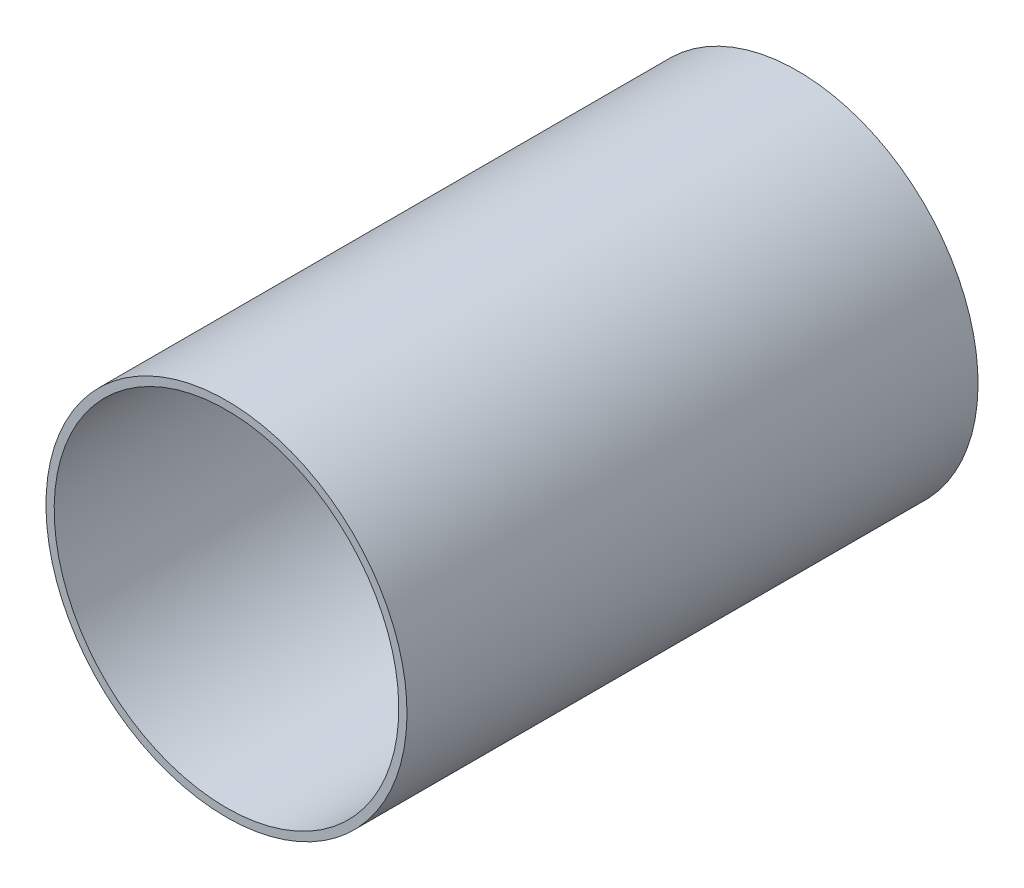
ISO-10303-21;
HEADER;
FILE_DESCRIPTION(('STEP AP214'),'2;1');
FILE_NAME('part.step','',(''),(''),'','','');
FILE_SCHEMA(('AUTOMOTIVE_DESIGN { 1 0 10303 214 1 1 1 1 }'));
ENDSEC;
DATA;
#1=APPLICATION_CONTEXT('core data for automotive mechanical design processes');
#2=APPLICATION_PROTOCOL_DEFINITION('international standard','automotive_design',2000,#1);
#3=PRODUCT_CONTEXT('',#1,'mechanical');
#4=PRODUCT('Part','Part','',(#3));
#5=PRODUCT_RELATED_PRODUCT_CATEGORY('part','',(#4));
#6=PRODUCT_DEFINITION_FORMATION('','',#4);
#7=PRODUCT_DEFINITION_CONTEXT('part definition',#1,'design');
#8=PRODUCT_DEFINITION('design','',#6,#7);
#9=PRODUCT_DEFINITION_SHAPE('','',#8);
#10=(LENGTH_UNIT() NAMED_UNIT(*) SI_UNIT(.MILLI.,.METRE.));
#11=(NAMED_UNIT(*) PLANE_ANGLE_UNIT() SI_UNIT($,.RADIAN.));
#12=(NAMED_UNIT(*) SI_UNIT($,.STERADIAN.) SOLID_ANGLE_UNIT());
#13=UNCERTAINTY_MEASURE_WITH_UNIT(LENGTH_MEASURE(1.E-05),#10,'distance_accuracy_value','');
#14=(GEOMETRIC_REPRESENTATION_CONTEXT(3) GLOBAL_UNCERTAINTY_ASSIGNED_CONTEXT((#13)) GLOBAL_UNIT_ASSIGNED_CONTEXT((#10,
#11,#12)) REPRESENTATION_CONTEXT('',''));
#15=CARTESIAN_POINT('',(0.,0.,0.));
#16=DIRECTION('',(0.,0.,1.));
#17=DIRECTION('',(1.,0.,0.));
#18=AXIS2_PLACEMENT_3D('',#15,#16,#17);
#19=CARTESIAN_POINT('',(144.202,-113.984,-0.045));
#20=DIRECTION('',(0.,0.,-1.));
#21=DIRECTION('',(0.,-1.,0.));
#22=AXIS2_PLACEMENT_3D('',#19,#20,#21);
#23=CYLINDRICAL_SURFACE('',#22,0.525);
#24=CARTESIAN_POINT('',(144.202,-113.984,-0.035));
#25=DIRECTION('',(0.,0.,-1.));
#26=DIRECTION('',(0.,-1.,0.));
#27=AXIS2_PLACEMENT_3D('',#24,#25,#26);
#28=CIRCLE('',#27,0.525);
#29=CARTESIAN_POINT('',(144.202,-114.509,-0.035));
#30=VERTEX_POINT('',#29);
#31=EDGE_CURVE('E64',#30,#30,#28,.T.);
#32=ORIENTED_EDGE('',*,*,#31,.T.);
#33=DIRECTION('',(0.,0.,1.));
#34=VECTOR('',#33,1.);
#35=CARTESIAN_POINT('',(144.202,-114.509,-0.045));
#36=LINE('',#35,#34);
#37=CARTESIAN_POINT('',(144.202,-114.509,1.705));
#38=VERTEX_POINT('',#37);
#39=EDGE_CURVE('E11',#30,#38,#36,.T.);
#40=ORIENTED_EDGE('',*,*,#39,.T.);
#41=CARTESIAN_POINT('',(144.202,-113.984,1.705));
#42=DIRECTION('',(0.,0.,-1.));
#43=DIRECTION('',(0.,-1.,0.));
#44=AXIS2_PLACEMENT_3D('',#41,#42,#43);
#45=CIRCLE('',#44,0.525);
#46=EDGE_CURVE('E25',#38,#38,#45,.T.);
#47=ORIENTED_EDGE('',*,*,#46,.F.);
#48=ORIENTED_EDGE('',*,*,#39,.F.);
#49=EDGE_LOOP('',(#32,#40,#47,#48));
#50=FACE_BOUND('',#49,.T.);
#51=ADVANCED_FACE('F17',(#50),#23,.F.);
#52=CARTESIAN_POINT('',(144.202,-114.534,1.705));
#53=DIRECTION('',(0.,0.,1.));
#54=DIRECTION('',(1.,0.,0.));
#55=AXIS2_PLACEMENT_3D('',#52,#53,#54);
#56=PLANE('',#55);
#57=ORIENTED_EDGE('',*,*,#46,.T.);
#58=EDGE_LOOP('',(#57));
#59=FACE_BOUND('',#58,.T.);
#60=CARTESIAN_POINT('',(144.202,-113.984,1.705));
#61=DIRECTION('',(0.,0.,1.));
#62=DIRECTION('',(0.,-1.,0.));
#63=AXIS2_PLACEMENT_3D('',#60,#61,#62);
#64=CIRCLE('',#63,0.55);
#65=CARTESIAN_POINT('',(144.202,-114.534,1.705));
#66=VERTEX_POINT('',#65);
#67=EDGE_CURVE('E56',#66,#66,#64,.T.);
#68=ORIENTED_EDGE('',*,*,#67,.T.);
#69=EDGE_LOOP('',(#68));
#70=FACE_BOUND('',#69,.T.);
#71=ADVANCED_FACE('F73',(#59,#70),#56,.T.);
#72=CARTESIAN_POINT('',(144.202,-114.534,-0.035));
#73=DIRECTION('',(0.,0.,1.));
#74=DIRECTION('',(1.,0.,0.));
#75=AXIS2_PLACEMENT_3D('',#72,#73,#74);
#76=PLANE('',#75);
#77=ORIENTED_EDGE('',*,*,#31,.F.);
#78=EDGE_LOOP('',(#77));
#79=FACE_BOUND('',#78,.T.);
#80=CARTESIAN_POINT('',(144.202,-113.984,-0.035));
#81=DIRECTION('',(0.,0.,1.));
#82=DIRECTION('',(0.,-1.,0.));
#83=AXIS2_PLACEMENT_3D('',#80,#81,#82);
#84=CIRCLE('',#83,0.55);
#85=CARTESIAN_POINT('',(144.202,-114.534,-0.035));
#86=VERTEX_POINT('',#85);
#87=EDGE_CURVE('E55',#86,#86,#84,.T.);
#88=ORIENTED_EDGE('',*,*,#87,.F.);
#89=EDGE_LOOP('',(#88));
#90=FACE_BOUND('',#89,.T.);
#91=ADVANCED_FACE('F82',(#79,#90),#76,.F.);
#92=CARTESIAN_POINT('',(144.202,-113.984,-0.035));
#93=DIRECTION('',(0.,0.,-1.));
#94=DIRECTION('',(0.,-1.,0.));
#95=AXIS2_PLACEMENT_3D('',#92,#93,#94);
#96=CYLINDRICAL_SURFACE('',#95,0.55);
#97=ORIENTED_EDGE('',*,*,#87,.T.);
#98=DIRECTION('',(0.,0.,1.));
#99=VECTOR('',#98,1.);
#100=CARTESIAN_POINT('',(144.202,-114.534,-0.035));
#101=LINE('',#100,#99);
#102=EDGE_CURVE('E52',#86,#66,#101,.T.);
#103=ORIENTED_EDGE('',*,*,#102,.T.);
#104=ORIENTED_EDGE('',*,*,#67,.F.);
#105=ORIENTED_EDGE('',*,*,#102,.F.);
#106=EDGE_LOOP('',(#97,#103,#104,#105));
#107=FACE_BOUND('',#106,.T.);
#108=ADVANCED_FACE('F53',(#107),#96,.T.);
#109=CLOSED_SHELL('',(#51,#71,#91,#108));
#110=MANIFOLD_SOLID_BREP('B1',#109);
#111=ADVANCED_BREP_SHAPE_REPRESENTATION('',(#18,#110),#14);
#112=SHAPE_DEFINITION_REPRESENTATION(#9,#111);
ENDSEC;
END-ISO-10303-21;
